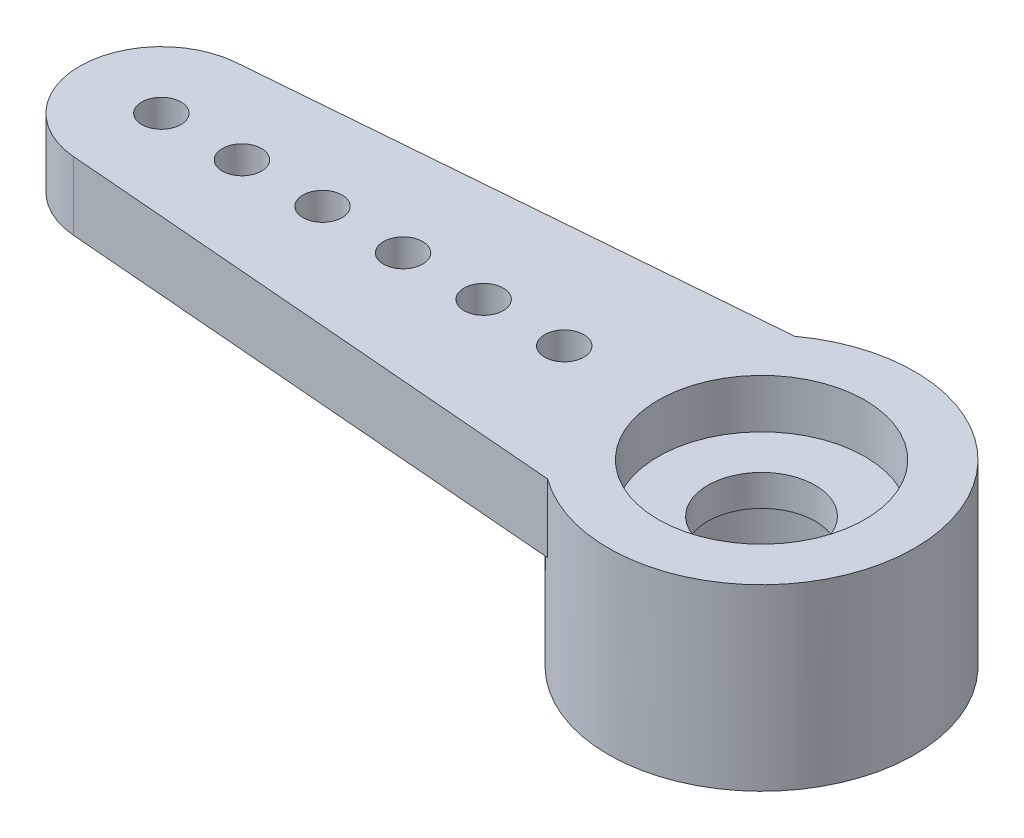
ISO-10303-21;
HEADER;
FILE_DESCRIPTION(('STEP AP214'),'2;1');
FILE_NAME('part.step','',(''),(''),'','','');
FILE_SCHEMA(('AUTOMOTIVE_DESIGN { 1 0 10303 214 1 1 1 1 }'));
ENDSEC;
DATA;
#1=APPLICATION_CONTEXT('core data for automotive mechanical design processes');
#2=APPLICATION_PROTOCOL_DEFINITION('international standard','automotive_design',2000,#1);
#3=PRODUCT_CONTEXT('',#1,'mechanical');
#4=PRODUCT('Part','Part','',(#3));
#5=PRODUCT_RELATED_PRODUCT_CATEGORY('part','',(#4));
#6=PRODUCT_DEFINITION_FORMATION('','',#4);
#7=PRODUCT_DEFINITION_CONTEXT('part definition',#1,'design');
#8=PRODUCT_DEFINITION('design','',#6,#7);
#9=PRODUCT_DEFINITION_SHAPE('','',#8);
#10=(LENGTH_UNIT() NAMED_UNIT(*) SI_UNIT(.MILLI.,.METRE.));
#11=(NAMED_UNIT(*) PLANE_ANGLE_UNIT() SI_UNIT($,.RADIAN.));
#12=(NAMED_UNIT(*) SI_UNIT($,.STERADIAN.) SOLID_ANGLE_UNIT());
#13=UNCERTAINTY_MEASURE_WITH_UNIT(LENGTH_MEASURE(1.E-05),#10,'distance_accuracy_value','');
#14=(GEOMETRIC_REPRESENTATION_CONTEXT(3) GLOBAL_UNCERTAINTY_ASSIGNED_CONTEXT((#13)) GLOBAL_UNIT_ASSIGNED_CONTEXT((#10,
#11,#12)) REPRESENTATION_CONTEXT('',''));
#15=CARTESIAN_POINT('',(0.,0.,0.));
#16=DIRECTION('',(0.,0.,1.));
#17=DIRECTION('',(1.,0.,0.));
#18=AXIS2_PLACEMENT_3D('',#15,#16,#17);
#19=CARTESIAN_POINT('',(0.,-2.6162,0.));
#20=DIRECTION('',(0.,1.,0.));
#21=DIRECTION('',(0.,0.,1.));
#22=AXIS2_PLACEMENT_3D('',#19,#20,#21);
#23=CYLINDRICAL_SURFACE('',#22,1.27);
#24=CARTESIAN_POINT('',(0.,0.4572,0.));
#25=DIRECTION('',(0.,1.,0.));
#26=DIRECTION('',(0.,0.,1.));
#27=AXIS2_PLACEMENT_3D('',#24,#25,#26);
#28=CIRCLE('',#27,1.27);
#29=CARTESIAN_POINT('',(0.,0.4572,1.27));
#30=VERTEX_POINT('',#29);
#31=EDGE_CURVE('E131',#30,#30,#28,.F.);
#32=ORIENTED_EDGE('',*,*,#31,.F.);
#33=EDGE_LOOP('',(#32));
#34=FACE_BOUND('',#33,.T.);
#35=CARTESIAN_POINT('',(0.,-0.2794,0.));
#36=DIRECTION('',(0.,-1.,0.));
#37=DIRECTION('',(0.,0.,-1.));
#38=AXIS2_PLACEMENT_3D('',#35,#36,#37);
#39=CIRCLE('',#38,1.27);
#40=CARTESIAN_POINT('',(0.,-0.2794,-1.27));
#41=VERTEX_POINT('',#40);
#42=EDGE_CURVE('E38',#41,#41,#39,.F.);
#43=ORIENTED_EDGE('',*,*,#42,.F.);
#44=EDGE_LOOP('',(#43));
#45=FACE_BOUND('',#44,.T.);
#46=ADVANCED_FACE('F34',(#34,#45),#23,.F.);
#47=CARTESIAN_POINT('',(0.,1.6129,0.));
#48=DIRECTION('',(0.,-1.,0.));
#49=DIRECTION('',(0.,0.,-1.));
#50=AXIS2_PLACEMENT_3D('',#47,#48,#49);
#51=CYLINDRICAL_SURFACE('',#50,3.6195);
#52=DIRECTION('',(0.,-1.,0.));
#53=VECTOR('',#52,1.);
#54=CARTESIAN_POINT('',(-2.13741415032277,1.6129,2.921));
#55=LINE('',#54,#53);
#56=CARTESIAN_POINT('',(-2.13741415032277,1.6129,2.921));
#57=VERTEX_POINT('',#56);
#58=CARTESIAN_POINT('',(-2.13741415032277,0.,2.921));
#59=VERTEX_POINT('',#58);
#60=EDGE_CURVE('E92',#57,#59,#55,.T.);
#61=ORIENTED_EDGE('',*,*,#60,.T.);
#62=CARTESIAN_POINT('',(0.,0.,0.));
#63=DIRECTION('',(0.,1.,0.));
#64=DIRECTION('',(0.,0.,1.));
#65=AXIS2_PLACEMENT_3D('',#62,#63,#64);
#66=CIRCLE('',#65,3.6195);
#67=CARTESIAN_POINT('',(-2.13741415032277,0.,-2.921));
#68=VERTEX_POINT('',#67);
#69=EDGE_CURVE('E11',#68,#59,#66,.T.);
#70=ORIENTED_EDGE('',*,*,#69,.F.);
#71=DIRECTION('',(0.,-1.,0.));
#72=VECTOR('',#71,1.);
#73=CARTESIAN_POINT('',(-2.13741415032277,1.6129,-2.921));
#74=LINE('',#73,#72);
#75=CARTESIAN_POINT('',(-2.13741415032277,1.6129,-2.921));
#76=VERTEX_POINT('',#75);
#77=EDGE_CURVE('E44',#76,#68,#74,.T.);
#78=ORIENTED_EDGE('',*,*,#77,.F.);
#79=CARTESIAN_POINT('',(0.,1.6129,0.));
#80=DIRECTION('',(0.,1.,0.));
#81=DIRECTION('',(0.,0.,1.));
#82=AXIS2_PLACEMENT_3D('',#79,#80,#81);
#83=CIRCLE('',#82,3.6195);
#84=EDGE_CURVE('E95',#57,#76,#83,.T.);
#85=ORIENTED_EDGE('',*,*,#84,.F.);
#86=EDGE_LOOP('',(#61,#70,#78,#85));
#87=FACE_BOUND('',#86,.T.);
#88=CARTESIAN_POINT('',(0.,-2.6162,0.));
#89=DIRECTION('',(0.,1.,0.));
#90=DIRECTION('',(0.,0.,1.));
#91=AXIS2_PLACEMENT_3D('',#88,#89,#90);
#92=CIRCLE('',#91,3.6195);
#93=CARTESIAN_POINT('',(0.,-2.6162,3.6195));
#94=VERTEX_POINT('',#93);
#95=EDGE_CURVE('E110',#94,#94,#92,.T.);
#96=ORIENTED_EDGE('',*,*,#95,.T.);
#97=EDGE_LOOP('',(#96));
#98=FACE_BOUND('',#97,.T.);
#99=ADVANCED_FACE('F36',(#87,#98),#51,.T.);
#100=CARTESIAN_POINT('',(-14.3472059875435,1.6129,-1.92399632761551));
#101=DIRECTION('',(0.0813851986860156,0.,0.996682722552587));
#102=DIRECTION('',(0.996682722552587,0.,-0.0813851986860156));
#103=AXIS2_PLACEMENT_3D('',#100,#101,#102);
#104=PLANE('',#103);
#105=DIRECTION('',(-0.996682722552587,0.,0.0813851986860156));
#106=VECTOR('',#105,1.);
#107=CARTESIAN_POINT('',(-14.3472059875435,0.,-1.92399632761551));
#108=LINE('',#107,#106);
#109=CARTESIAN_POINT('',(-14.3472059875435,0.,-1.92399632761551));
#110=VERTEX_POINT('',#109);
#111=EDGE_CURVE('E68',#68,#110,#108,.T.);
#112=ORIENTED_EDGE('',*,*,#111,.T.);
#113=DIRECTION('',(0.,-1.,0.));
#114=VECTOR('',#113,1.);
#115=CARTESIAN_POINT('',(-14.3472059875435,1.6129,-1.92399632761551));
#116=LINE('',#115,#114);
#117=CARTESIAN_POINT('',(-14.3472059875435,1.6129,-1.92399632761551));
#118=VERTEX_POINT('',#117);
#119=EDGE_CURVE('E99',#118,#110,#116,.T.);
#120=ORIENTED_EDGE('',*,*,#119,.F.);
#121=DIRECTION('',(-0.996682722552587,0.,0.0813851986860156));
#122=VECTOR('',#121,1.);
#123=CARTESIAN_POINT('',(-14.3472059875435,1.6129,-1.92399632761551));
#124=LINE('',#123,#122);
#125=EDGE_CURVE('E80',#76,#118,#124,.T.);
#126=ORIENTED_EDGE('',*,*,#125,.F.);
#127=ORIENTED_EDGE('',*,*,#77,.T.);
#128=EDGE_LOOP('',(#112,#120,#126,#127));
#129=FACE_BOUND('',#128,.T.);
#130=ADVANCED_FACE('F168',(#129),#104,.F.);
#131=CARTESIAN_POINT('',(-14.1901,1.6129,0.));
#132=DIRECTION('',(0.,-1.,0.));
#133=DIRECTION('',(0.,0.,-1.));
#134=AXIS2_PLACEMENT_3D('',#131,#132,#133);
#135=CYLINDRICAL_SURFACE('',#134,1.9304);
#136=CARTESIAN_POINT('',(-14.1901,0.,0.));
#137=DIRECTION('',(0.,1.,0.));
#138=DIRECTION('',(0.,0.,1.));
#139=AXIS2_PLACEMENT_3D('',#136,#137,#138);
#140=CIRCLE('',#139,1.9304);
#141=CARTESIAN_POINT('',(-14.3472059875435,0.,1.92399632761552));
#142=VERTEX_POINT('',#141);
#143=EDGE_CURVE('E75',#110,#142,#140,.T.);
#144=ORIENTED_EDGE('',*,*,#143,.T.);
#145=DIRECTION('',(0.,-1.,0.));
#146=VECTOR('',#145,1.);
#147=CARTESIAN_POINT('',(-14.3472059875435,1.6129,1.92399632761552));
#148=LINE('',#147,#146);
#149=CARTESIAN_POINT('',(-14.3472059875435,1.6129,1.92399632761552));
#150=VERTEX_POINT('',#149);
#151=EDGE_CURVE('E94',#150,#142,#148,.T.);
#152=ORIENTED_EDGE('',*,*,#151,.F.);
#153=CARTESIAN_POINT('',(-14.1901,1.6129,0.));
#154=DIRECTION('',(0.,1.,0.));
#155=DIRECTION('',(0.,0.,1.));
#156=AXIS2_PLACEMENT_3D('',#153,#154,#155);
#157=CIRCLE('',#156,1.9304);
#158=EDGE_CURVE('E101',#118,#150,#157,.T.);
#159=ORIENTED_EDGE('',*,*,#158,.F.);
#160=ORIENTED_EDGE('',*,*,#119,.T.);
#161=EDGE_LOOP('',(#144,#152,#159,#160));
#162=FACE_BOUND('',#161,.T.);
#163=ADVANCED_FACE('F166',(#162),#135,.T.);
#164=CARTESIAN_POINT('',(-14.3472059875435,1.6129,1.92399632761552));
#165=DIRECTION('',(0.0813851986860153,0.,-0.996682722552587));
#166=DIRECTION('',(-0.996682722552587,0.,-0.0813851986860153));
#167=AXIS2_PLACEMENT_3D('',#164,#165,#166);
#168=PLANE('',#167);
#169=DIRECTION('',(0.996682722552587,0.,0.0813851986860153));
#170=VECTOR('',#169,1.);
#171=CARTESIAN_POINT('',(-14.3472059875435,0.,1.92399632761552));
#172=LINE('',#171,#170);
#173=EDGE_CURVE('E86',#142,#59,#172,.T.);
#174=ORIENTED_EDGE('',*,*,#173,.T.);
#175=ORIENTED_EDGE('',*,*,#60,.F.);
#176=DIRECTION('',(0.996682722552587,0.,0.0813851986860153));
#177=VECTOR('',#176,1.);
#178=CARTESIAN_POINT('',(-14.3472059875435,1.6129,1.92399632761552));
#179=LINE('',#178,#177);
#180=EDGE_CURVE('E53',#150,#57,#179,.T.);
#181=ORIENTED_EDGE('',*,*,#180,.F.);
#182=ORIENTED_EDGE('',*,*,#151,.T.);
#183=EDGE_LOOP('',(#174,#175,#181,#182));
#184=FACE_BOUND('',#183,.T.);
#185=ADVANCED_FACE('F91',(#184),#168,.F.);
#186=CARTESIAN_POINT('',(0.,1.6129,0.));
#187=DIRECTION('',(0.,1.,0.));
#188=DIRECTION('',(0.,0.,1.));
#189=AXIS2_PLACEMENT_3D('',#186,#187,#188);
#190=PLANE('',#189);
#191=CARTESIAN_POINT('',(0.,1.6129,0.));
#192=DIRECTION('',(0.,1.,0.));
#193=DIRECTION('',(0.,0.,1.));
#194=AXIS2_PLACEMENT_3D('',#191,#192,#193);
#195=CIRCLE('',#194,2.44475);
#196=CARTESIAN_POINT('',(0.,1.6129,2.44475));
#197=VERTEX_POINT('',#196);
#198=EDGE_CURVE('E139',#197,#197,#195,.T.);
#199=ORIENTED_EDGE('',*,*,#198,.F.);
#200=EDGE_LOOP('',(#199));
#201=FACE_BOUND('',#200,.T.);
#202=CARTESIAN_POINT('',(-12.2851,1.6129,0.));
#203=DIRECTION('',(0.,1.,0.));
#204=DIRECTION('',(0.,0.,1.));
#205=AXIS2_PLACEMENT_3D('',#202,#203,#204);
#206=CIRCLE('',#205,0.46355);
#207=CARTESIAN_POINT('',(-12.2851,1.6129,0.46355));
#208=VERTEX_POINT('',#207);
#209=EDGE_CURVE('E130',#208,#208,#206,.T.);
#210=ORIENTED_EDGE('',*,*,#209,.F.);
#211=EDGE_LOOP('',(#210));
#212=FACE_BOUND('',#211,.T.);
#213=CARTESIAN_POINT('',(-10.3801,1.6129,0.));
#214=DIRECTION('',(0.,1.,0.));
#215=DIRECTION('',(0.,0.,1.));
#216=AXIS2_PLACEMENT_3D('',#213,#214,#215);
#217=CIRCLE('',#216,0.46355);
#218=CARTESIAN_POINT('',(-10.3801,1.6129,0.46355));
#219=VERTEX_POINT('',#218);
#220=EDGE_CURVE('E127',#219,#219,#217,.T.);
#221=ORIENTED_EDGE('',*,*,#220,.F.);
#222=EDGE_LOOP('',(#221));
#223=FACE_BOUND('',#222,.T.);
#224=CARTESIAN_POINT('',(-8.47509999999999,1.6129,0.));
#225=DIRECTION('',(0.,1.,0.));
#226=DIRECTION('',(0.,0.,1.));
#227=AXIS2_PLACEMENT_3D('',#224,#225,#226);
#228=CIRCLE('',#227,0.46355);
#229=CARTESIAN_POINT('',(-8.47509999999999,1.6129,0.46355));
#230=VERTEX_POINT('',#229);
#231=EDGE_CURVE('E123',#230,#230,#228,.T.);
#232=ORIENTED_EDGE('',*,*,#231,.F.);
#233=EDGE_LOOP('',(#232));
#234=FACE_BOUND('',#233,.T.);
#235=CARTESIAN_POINT('',(-6.57009999999999,1.6129,0.));
#236=DIRECTION('',(0.,1.,0.));
#237=DIRECTION('',(0.,0.,1.));
#238=AXIS2_PLACEMENT_3D('',#235,#236,#237);
#239=CIRCLE('',#238,0.46355);
#240=CARTESIAN_POINT('',(-6.57009999999999,1.6129,0.46355));
#241=VERTEX_POINT('',#240);
#242=EDGE_CURVE('E119',#241,#241,#239,.T.);
#243=ORIENTED_EDGE('',*,*,#242,.F.);
#244=EDGE_LOOP('',(#243));
#245=FACE_BOUND('',#244,.T.);
#246=CARTESIAN_POINT('',(-4.66509999999999,1.6129,0.));
#247=DIRECTION('',(0.,1.,0.));
#248=DIRECTION('',(0.,0.,1.));
#249=AXIS2_PLACEMENT_3D('',#246,#247,#248);
#250=CIRCLE('',#249,0.46355);
#251=CARTESIAN_POINT('',(-4.66509999999999,1.6129,0.46355));
#252=VERTEX_POINT('',#251);
#253=EDGE_CURVE('E115',#252,#252,#250,.T.);
#254=ORIENTED_EDGE('',*,*,#253,.F.);
#255=EDGE_LOOP('',(#254));
#256=FACE_BOUND('',#255,.T.);
#257=CARTESIAN_POINT('',(-14.1901,1.6129,0.));
#258=DIRECTION('',(0.,1.,0.));
#259=DIRECTION('',(0.,0.,1.));
#260=AXIS2_PLACEMENT_3D('',#257,#258,#259);
#261=CIRCLE('',#260,0.46355);
#262=CARTESIAN_POINT('',(-14.1901,1.6129,0.463550000000003));
#263=VERTEX_POINT('',#262);
#264=EDGE_CURVE('E111',#263,#263,#261,.T.);
#265=ORIENTED_EDGE('',*,*,#264,.F.);
#266=EDGE_LOOP('',(#265));
#267=FACE_BOUND('',#266,.T.);
#268=ORIENTED_EDGE('',*,*,#180,.T.);
#269=ORIENTED_EDGE('',*,*,#84,.T.);
#270=ORIENTED_EDGE('',*,*,#125,.T.);
#271=ORIENTED_EDGE('',*,*,#158,.T.);
#272=EDGE_LOOP('',(#268,#269,#270,#271));
#273=FACE_BOUND('',#272,.T.);
#274=ADVANCED_FACE('F165',(#201,#212,#223,#234,#245,#256,#267,#273),#190,.T.);
#275=CARTESIAN_POINT('',(0.,0.,0.));
#276=DIRECTION('',(0.,1.,0.));
#277=DIRECTION('',(0.,0.,1.));
#278=AXIS2_PLACEMENT_3D('',#275,#276,#277);
#279=PLANE('',#278);
#280=CARTESIAN_POINT('',(-12.2851,0.,0.));
#281=DIRECTION('',(0.,1.,0.));
#282=DIRECTION('',(0.,0.,1.));
#283=AXIS2_PLACEMENT_3D('',#280,#281,#282);
#284=CIRCLE('',#283,0.46355);
#285=CARTESIAN_POINT('',(-12.2851,0.,0.46355));
#286=VERTEX_POINT('',#285);
#287=EDGE_CURVE('E128',#286,#286,#284,.T.);
#288=ORIENTED_EDGE('',*,*,#287,.T.);
#289=EDGE_LOOP('',(#288));
#290=FACE_BOUND('',#289,.T.);
#291=CARTESIAN_POINT('',(-10.3801,0.,0.));
#292=DIRECTION('',(0.,1.,0.));
#293=DIRECTION('',(0.,0.,1.));
#294=AXIS2_PLACEMENT_3D('',#291,#292,#293);
#295=CIRCLE('',#294,0.46355);
#296=CARTESIAN_POINT('',(-10.3801,0.,0.46355));
#297=VERTEX_POINT('',#296);
#298=EDGE_CURVE('E124',#297,#297,#295,.T.);
#299=ORIENTED_EDGE('',*,*,#298,.T.);
#300=EDGE_LOOP('',(#299));
#301=FACE_BOUND('',#300,.T.);
#302=CARTESIAN_POINT('',(-8.47509999999999,0.,0.));
#303=DIRECTION('',(0.,1.,0.));
#304=DIRECTION('',(0.,0.,1.));
#305=AXIS2_PLACEMENT_3D('',#302,#303,#304);
#306=CIRCLE('',#305,0.46355);
#307=CARTESIAN_POINT('',(-8.47509999999999,0.,0.46355));
#308=VERTEX_POINT('',#307);
#309=EDGE_CURVE('E120',#308,#308,#306,.T.);
#310=ORIENTED_EDGE('',*,*,#309,.T.);
#311=EDGE_LOOP('',(#310));
#312=FACE_BOUND('',#311,.T.);
#313=CARTESIAN_POINT('',(-6.57009999999999,0.,0.));
#314=DIRECTION('',(0.,1.,0.));
#315=DIRECTION('',(0.,0.,1.));
#316=AXIS2_PLACEMENT_3D('',#313,#314,#315);
#317=CIRCLE('',#316,0.46355);
#318=CARTESIAN_POINT('',(-6.57009999999999,0.,0.46355));
#319=VERTEX_POINT('',#318);
#320=EDGE_CURVE('E116',#319,#319,#317,.T.);
#321=ORIENTED_EDGE('',*,*,#320,.T.);
#322=EDGE_LOOP('',(#321));
#323=FACE_BOUND('',#322,.T.);
#324=CARTESIAN_POINT('',(-4.66509999999999,0.,0.));
#325=DIRECTION('',(0.,1.,0.));
#326=DIRECTION('',(0.,0.,1.));
#327=AXIS2_PLACEMENT_3D('',#324,#325,#326);
#328=CIRCLE('',#327,0.46355);
#329=CARTESIAN_POINT('',(-4.66509999999999,0.,0.46355));
#330=VERTEX_POINT('',#329);
#331=EDGE_CURVE('E112',#330,#330,#328,.T.);
#332=ORIENTED_EDGE('',*,*,#331,.T.);
#333=EDGE_LOOP('',(#332));
#334=FACE_BOUND('',#333,.T.);
#335=CARTESIAN_POINT('',(-14.1901,0.,0.));
#336=DIRECTION('',(0.,1.,0.));
#337=DIRECTION('',(0.,0.,1.));
#338=AXIS2_PLACEMENT_3D('',#335,#336,#337);
#339=CIRCLE('',#338,0.46355);
#340=CARTESIAN_POINT('',(-14.1901,0.,0.463550000000003));
#341=VERTEX_POINT('',#340);
#342=EDGE_CURVE('E107',#341,#341,#339,.T.);
#343=ORIENTED_EDGE('',*,*,#342,.T.);
#344=EDGE_LOOP('',(#343));
#345=FACE_BOUND('',#344,.T.);
#346=ORIENTED_EDGE('',*,*,#111,.F.);
#347=ORIENTED_EDGE('',*,*,#69,.T.);
#348=ORIENTED_EDGE('',*,*,#173,.F.);
#349=ORIENTED_EDGE('',*,*,#143,.F.);
#350=EDGE_LOOP('',(#346,#347,#348,#349));
#351=FACE_BOUND('',#350,.T.);
#352=ADVANCED_FACE('F85',(#290,#301,#312,#323,#334,#345,#351),#279,.F.);
#353=CARTESIAN_POINT('',(0.,-2.6162,0.));
#354=DIRECTION('',(0.,1.,0.));
#355=DIRECTION('',(0.,0.,1.));
#356=AXIS2_PLACEMENT_3D('',#353,#354,#355);
#357=PLANE('',#356);
#358=CARTESIAN_POINT('',(0.,-2.6162,0.));
#359=DIRECTION('',(0.,-1.,0.));
#360=DIRECTION('',(0.,0.,-1.));
#361=AXIS2_PLACEMENT_3D('',#358,#359,#360);
#362=CIRCLE('',#361,2.286);
#363=CARTESIAN_POINT('',(0.,-2.6162,-2.286));
#364=VERTEX_POINT('',#363);
#365=EDGE_CURVE('E146',#364,#364,#362,.T.);
#366=ORIENTED_EDGE('',*,*,#365,.F.);
#367=EDGE_LOOP('',(#366));
#368=FACE_BOUND('',#367,.T.);
#369=ORIENTED_EDGE('',*,*,#95,.F.);
#370=EDGE_LOOP('',(#369));
#371=FACE_BOUND('',#370,.T.);
#372=ADVANCED_FACE('F189',(#368,#371),#357,.F.);
#373=CARTESIAN_POINT('',(-14.1901,-2.6162,0.));
#374=DIRECTION('',(0.,1.,0.));
#375=DIRECTION('',(0.,0.,1.));
#376=AXIS2_PLACEMENT_3D('',#373,#374,#375);
#377=CYLINDRICAL_SURFACE('',#376,0.46355);
#378=ORIENTED_EDGE('',*,*,#264,.T.);
#379=EDGE_LOOP('',(#378));
#380=FACE_BOUND('',#379,.T.);
#381=ORIENTED_EDGE('',*,*,#342,.F.);
#382=EDGE_LOOP('',(#381));
#383=FACE_BOUND('',#382,.T.);
#384=ADVANCED_FACE('F186',(#380,#383),#377,.F.);
#385=CARTESIAN_POINT('',(-4.66509999999999,-2.6162,0.));
#386=DIRECTION('',(0.,1.,0.));
#387=DIRECTION('',(0.,0.,1.));
#388=AXIS2_PLACEMENT_3D('',#385,#386,#387);
#389=CYLINDRICAL_SURFACE('',#388,0.46355);
#390=ORIENTED_EDGE('',*,*,#253,.T.);
#391=EDGE_LOOP('',(#390));
#392=FACE_BOUND('',#391,.T.);
#393=ORIENTED_EDGE('',*,*,#331,.F.);
#394=EDGE_LOOP('',(#393));
#395=FACE_BOUND('',#394,.T.);
#396=ADVANCED_FACE('F184',(#392,#395),#389,.F.);
#397=CARTESIAN_POINT('',(-6.57009999999999,-2.6162,0.));
#398=DIRECTION('',(0.,1.,0.));
#399=DIRECTION('',(0.,0.,1.));
#400=AXIS2_PLACEMENT_3D('',#397,#398,#399);
#401=CYLINDRICAL_SURFACE('',#400,0.46355);
#402=ORIENTED_EDGE('',*,*,#242,.T.);
#403=EDGE_LOOP('',(#402));
#404=FACE_BOUND('',#403,.T.);
#405=ORIENTED_EDGE('',*,*,#320,.F.);
#406=EDGE_LOOP('',(#405));
#407=FACE_BOUND('',#406,.T.);
#408=ADVANCED_FACE('F215',(#404,#407),#401,.F.);
#409=CARTESIAN_POINT('',(-8.47509999999999,-2.6162,0.));
#410=DIRECTION('',(0.,1.,0.));
#411=DIRECTION('',(0.,0.,1.));
#412=AXIS2_PLACEMENT_3D('',#409,#410,#411);
#413=CYLINDRICAL_SURFACE('',#412,0.46355);
#414=ORIENTED_EDGE('',*,*,#231,.T.);
#415=EDGE_LOOP('',(#414));
#416=FACE_BOUND('',#415,.T.);
#417=ORIENTED_EDGE('',*,*,#309,.F.);
#418=EDGE_LOOP('',(#417));
#419=FACE_BOUND('',#418,.T.);
#420=ADVANCED_FACE('F220',(#416,#419),#413,.F.);
#421=CARTESIAN_POINT('',(-10.3801,-2.6162,0.));
#422=DIRECTION('',(0.,1.,0.));
#423=DIRECTION('',(0.,0.,1.));
#424=AXIS2_PLACEMENT_3D('',#421,#422,#423);
#425=CYLINDRICAL_SURFACE('',#424,0.46355);
#426=ORIENTED_EDGE('',*,*,#220,.T.);
#427=EDGE_LOOP('',(#426));
#428=FACE_BOUND('',#427,.T.);
#429=ORIENTED_EDGE('',*,*,#298,.F.);
#430=EDGE_LOOP('',(#429));
#431=FACE_BOUND('',#430,.T.);
#432=ADVANCED_FACE('F229',(#428,#431),#425,.F.);
#433=CARTESIAN_POINT('',(-12.2851,-2.6162,0.));
#434=DIRECTION('',(0.,1.,0.));
#435=DIRECTION('',(0.,0.,1.));
#436=AXIS2_PLACEMENT_3D('',#433,#434,#435);
#437=CYLINDRICAL_SURFACE('',#436,0.46355);
#438=ORIENTED_EDGE('',*,*,#209,.T.);
#439=EDGE_LOOP('',(#438));
#440=FACE_BOUND('',#439,.T.);
#441=ORIENTED_EDGE('',*,*,#287,.F.);
#442=EDGE_LOOP('',(#441));
#443=FACE_BOUND('',#442,.T.);
#444=ADVANCED_FACE('F236',(#440,#443),#437,.F.);
#445=CARTESIAN_POINT('',(0.,0.4572,0.));
#446=DIRECTION('',(0.,1.,0.));
#447=DIRECTION('',(0.,0.,1.));
#448=AXIS2_PLACEMENT_3D('',#445,#446,#447);
#449=PLANE('',#448);
#450=CARTESIAN_POINT('',(0.,0.4572,0.));
#451=DIRECTION('',(0.,1.,0.));
#452=DIRECTION('',(0.,0.,1.));
#453=AXIS2_PLACEMENT_3D('',#450,#451,#452);
#454=CIRCLE('',#453,2.44475);
#455=CARTESIAN_POINT('',(0.,0.4572,2.44475));
#456=VERTEX_POINT('',#455);
#457=EDGE_CURVE('E133',#456,#456,#454,.T.);
#458=ORIENTED_EDGE('',*,*,#457,.T.);
#459=EDGE_LOOP('',(#458));
#460=FACE_BOUND('',#459,.T.);
#461=ORIENTED_EDGE('',*,*,#31,.T.);
#462=EDGE_LOOP('',(#461));
#463=FACE_BOUND('',#462,.T.);
#464=ADVANCED_FACE('F240',(#460,#463),#449,.T.);
#465=CARTESIAN_POINT('',(0.,0.4572,0.));
#466=DIRECTION('',(0.,1.,0.));
#467=DIRECTION('',(0.,0.,1.));
#468=AXIS2_PLACEMENT_3D('',#465,#466,#467);
#469=CYLINDRICAL_SURFACE('',#468,2.44475);
#470=ORIENTED_EDGE('',*,*,#457,.F.);
#471=EDGE_LOOP('',(#470));
#472=FACE_BOUND('',#471,.T.);
#473=ORIENTED_EDGE('',*,*,#198,.T.);
#474=EDGE_LOOP('',(#473));
#475=FACE_BOUND('',#474,.T.);
#476=ADVANCED_FACE('F242',(#472,#475),#469,.F.);
#477=CARTESIAN_POINT('',(0.,-0.2794,0.));
#478=DIRECTION('',(0.,-1.,0.));
#479=DIRECTION('',(0.,0.,-1.));
#480=AXIS2_PLACEMENT_3D('',#477,#478,#479);
#481=PLANE('',#480);
#482=CARTESIAN_POINT('',(0.,-0.2794,0.));
#483=DIRECTION('',(0.,-1.,0.));
#484=DIRECTION('',(0.,0.,-1.));
#485=AXIS2_PLACEMENT_3D('',#482,#483,#484);
#486=CIRCLE('',#485,2.286);
#487=CARTESIAN_POINT('',(0.,-0.2794,-2.286));
#488=VERTEX_POINT('',#487);
#489=EDGE_CURVE('E260',#488,#488,#486,.T.);
#490=ORIENTED_EDGE('',*,*,#489,.T.);
#491=EDGE_LOOP('',(#490));
#492=FACE_BOUND('',#491,.T.);
#493=ORIENTED_EDGE('',*,*,#42,.T.);
#494=EDGE_LOOP('',(#493));
#495=FACE_BOUND('',#494,.T.);
#496=ADVANCED_FACE('F245',(#492,#495),#481,.T.);
#497=CARTESIAN_POINT('',(0.,-0.2794,0.));
#498=DIRECTION('',(0.,-1.,0.));
#499=DIRECTION('',(0.,0.,-1.));
#500=AXIS2_PLACEMENT_3D('',#497,#498,#499);
#501=CYLINDRICAL_SURFACE('',#500,2.286);
#502=ORIENTED_EDGE('',*,*,#489,.F.);
#503=EDGE_LOOP('',(#502));
#504=FACE_BOUND('',#503,.T.);
#505=ORIENTED_EDGE('',*,*,#365,.T.);
#506=EDGE_LOOP('',(#505));
#507=FACE_BOUND('',#506,.T.);
#508=ADVANCED_FACE('F249',(#504,#507),#501,.F.);
#509=CLOSED_SHELL('',(#46,#99,#130,#163,#185,#274,#352,#372,#384,#396,#408,#420,#432,#444,#464,
#476,#496,#508));
#510=MANIFOLD_SOLID_BREP('B2',#509);
#511=ADVANCED_BREP_SHAPE_REPRESENTATION('',(#18,#510),#14);
#512=SHAPE_DEFINITION_REPRESENTATION(#9,#511);
ENDSEC;
END-ISO-10303-21;
